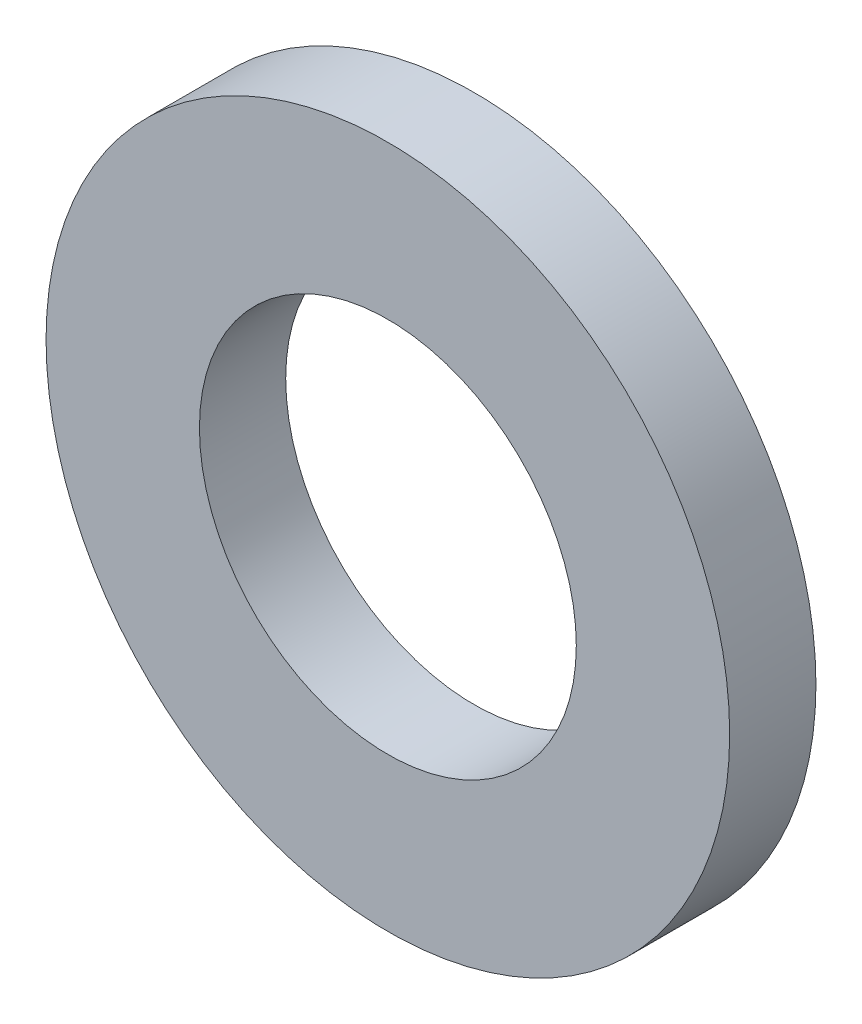
ISO-10303-21;
HEADER;
FILE_DESCRIPTION(('STEP AP214'),'2;1');
FILE_NAME('part.step','',(''),(''),'','','');
FILE_SCHEMA(('AUTOMOTIVE_DESIGN { 1 0 10303 214 1 1 1 1 }'));
ENDSEC;
DATA;
#1=APPLICATION_CONTEXT('core data for automotive mechanical design processes');
#2=APPLICATION_PROTOCOL_DEFINITION('international standard','automotive_design',2000,#1);
#3=PRODUCT_CONTEXT('',#1,'mechanical');
#4=PRODUCT('Part','Part','',(#3));
#5=PRODUCT_RELATED_PRODUCT_CATEGORY('part','',(#4));
#6=PRODUCT_DEFINITION_FORMATION('','',#4);
#7=PRODUCT_DEFINITION_CONTEXT('part definition',#1,'design');
#8=PRODUCT_DEFINITION('design','',#6,#7);
#9=PRODUCT_DEFINITION_SHAPE('','',#8);
#10=(LENGTH_UNIT() NAMED_UNIT(*) SI_UNIT(.MILLI.,.METRE.));
#11=(NAMED_UNIT(*) PLANE_ANGLE_UNIT() SI_UNIT($,.RADIAN.));
#12=(NAMED_UNIT(*) SI_UNIT($,.STERADIAN.) SOLID_ANGLE_UNIT());
#13=UNCERTAINTY_MEASURE_WITH_UNIT(LENGTH_MEASURE(1.E-05),#10,'distance_accuracy_value','');
#14=(GEOMETRIC_REPRESENTATION_CONTEXT(3) GLOBAL_UNCERTAINTY_ASSIGNED_CONTEXT((#13)) GLOBAL_UNIT_ASSIGNED_CONTEXT((#10,
#11,#12)) REPRESENTATION_CONTEXT('',''));
#15=CARTESIAN_POINT('',(0.,0.,0.));
#16=DIRECTION('',(0.,0.,1.));
#17=DIRECTION('',(1.,0.,0.));
#18=AXIS2_PLACEMENT_3D('',#15,#16,#17);
#19=CARTESIAN_POINT('',(0.,0.,-1.));
#20=DIRECTION('',(0.,0.,1.));
#21=DIRECTION('',(1.,0.,0.));
#22=AXIS2_PLACEMENT_3D('',#19,#20,#21);
#23=CYLINDRICAL_SURFACE('',#22,3.9624);
#24=CARTESIAN_POINT('',(0.,0.,-1.));
#25=DIRECTION('',(0.,0.,1.));
#26=DIRECTION('',(1.,0.,0.));
#27=AXIS2_PLACEMENT_3D('',#24,#25,#26);
#28=CIRCLE('',#27,3.9624);
#29=CARTESIAN_POINT('',(3.9624,0.,-1.));
#30=VERTEX_POINT('',#29);
#31=EDGE_CURVE('E10',#30,#30,#28,.T.);
#32=ORIENTED_EDGE('',*,*,#31,.T.);
#33=EDGE_LOOP('',(#32));
#34=FACE_BOUND('',#33,.T.);
#35=CARTESIAN_POINT('',(0.,0.,0.));
#36=DIRECTION('',(0.,0.,1.));
#37=DIRECTION('',(1.,0.,0.));
#38=AXIS2_PLACEMENT_3D('',#35,#36,#37);
#39=CIRCLE('',#38,3.9624);
#40=CARTESIAN_POINT('',(3.9624,0.,0.));
#41=VERTEX_POINT('',#40);
#42=EDGE_CURVE('E40',#41,#41,#39,.T.);
#43=ORIENTED_EDGE('',*,*,#42,.F.);
#44=EDGE_LOOP('',(#43));
#45=FACE_BOUND('',#44,.T.);
#46=ADVANCED_FACE('F37',(#34,#45),#23,.T.);
#47=CARTESIAN_POINT('',(0.,0.,-1.));
#48=DIRECTION('',(0.,0.,1.));
#49=DIRECTION('',(1.,0.,0.));
#50=AXIS2_PLACEMENT_3D('',#47,#48,#49);
#51=PLANE('',#50);
#52=CARTESIAN_POINT('',(0.,0.,-1.));
#53=DIRECTION('',(0.,0.,1.));
#54=DIRECTION('',(1.,0.,0.));
#55=AXIS2_PLACEMENT_3D('',#52,#53,#54);
#56=CIRCLE('',#55,2.1844);
#57=CARTESIAN_POINT('',(2.1844,0.,-1.));
#58=VERTEX_POINT('',#57);
#59=EDGE_CURVE('E49',#58,#58,#56,.T.);
#60=ORIENTED_EDGE('',*,*,#59,.T.);
#61=EDGE_LOOP('',(#60));
#62=FACE_BOUND('',#61,.T.);
#63=ORIENTED_EDGE('',*,*,#31,.F.);
#64=EDGE_LOOP('',(#63));
#65=FACE_BOUND('',#64,.T.);
#66=ADVANCED_FACE('F59',(#62,#65),#51,.F.);
#67=CARTESIAN_POINT('',(0.,0.,0.));
#68=DIRECTION('',(0.,0.,1.));
#69=DIRECTION('',(1.,0.,0.));
#70=AXIS2_PLACEMENT_3D('',#67,#68,#69);
#71=PLANE('',#70);
#72=CARTESIAN_POINT('',(0.,0.,0.));
#73=DIRECTION('',(0.,0.,1.));
#74=DIRECTION('',(1.,0.,0.));
#75=AXIS2_PLACEMENT_3D('',#72,#73,#74);
#76=CIRCLE('',#75,2.1844);
#77=CARTESIAN_POINT('',(2.1844,0.,0.));
#78=VERTEX_POINT('',#77);
#79=EDGE_CURVE('E51',#78,#78,#76,.T.);
#80=ORIENTED_EDGE('',*,*,#79,.F.);
#81=EDGE_LOOP('',(#80));
#82=FACE_BOUND('',#81,.T.);
#83=ORIENTED_EDGE('',*,*,#42,.T.);
#84=EDGE_LOOP('',(#83));
#85=FACE_BOUND('',#84,.T.);
#86=ADVANCED_FACE('F65',(#82,#85),#71,.T.);
#87=CARTESIAN_POINT('',(0.,0.,-1.));
#88=DIRECTION('',(0.,0.,1.));
#89=DIRECTION('',(1.,0.,0.));
#90=AXIS2_PLACEMENT_3D('',#87,#88,#89);
#91=CYLINDRICAL_SURFACE('',#90,2.1844);
#92=ORIENTED_EDGE('',*,*,#59,.F.);
#93=EDGE_LOOP('',(#92));
#94=FACE_BOUND('',#93,.T.);
#95=ORIENTED_EDGE('',*,*,#79,.T.);
#96=EDGE_LOOP('',(#95));
#97=FACE_BOUND('',#96,.T.);
#98=ADVANCED_FACE('F62',(#94,#97),#91,.F.);
#99=CLOSED_SHELL('',(#46,#66,#86,#98));
#100=MANIFOLD_SOLID_BREP('B2',#99);
#101=ADVANCED_BREP_SHAPE_REPRESENTATION('',(#18,#100),#14);
#102=SHAPE_DEFINITION_REPRESENTATION(#9,#101);
ENDSEC;
END-ISO-10303-21;
